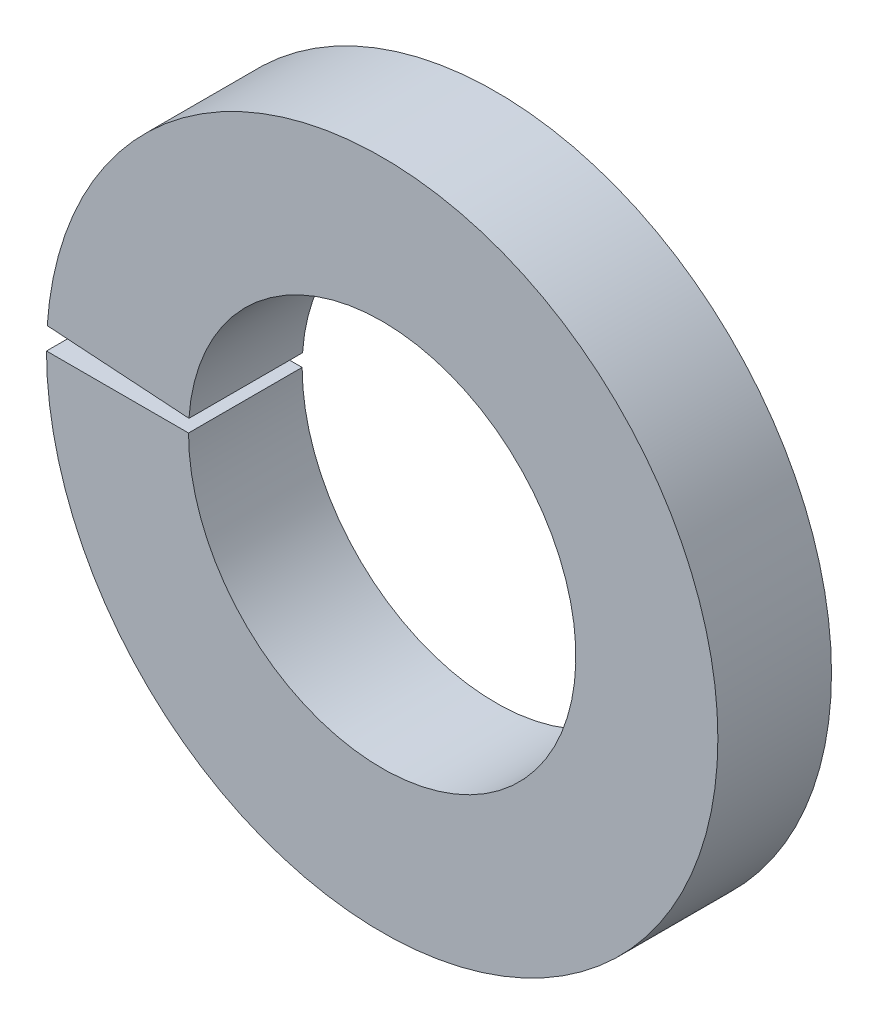
ISO-10303-21;
HEADER;
FILE_DESCRIPTION(('STEP AP214'),'2;1');
FILE_NAME('part.step','',(''),(''),'','','');
FILE_SCHEMA(('AUTOMOTIVE_DESIGN { 1 0 10303 214 1 1 1 1 }'));
ENDSEC;
DATA;
#1=APPLICATION_CONTEXT('core data for automotive mechanical design processes');
#2=APPLICATION_PROTOCOL_DEFINITION('international standard','automotive_design',2000,#1);
#3=PRODUCT_CONTEXT('',#1,'mechanical');
#4=PRODUCT('Part','Part','',(#3));
#5=PRODUCT_RELATED_PRODUCT_CATEGORY('part','',(#4));
#6=PRODUCT_DEFINITION_FORMATION('','',#4);
#7=PRODUCT_DEFINITION_CONTEXT('part definition',#1,'design');
#8=PRODUCT_DEFINITION('design','',#6,#7);
#9=PRODUCT_DEFINITION_SHAPE('','',#8);
#10=(LENGTH_UNIT() NAMED_UNIT(*) SI_UNIT(.MILLI.,.METRE.));
#11=(NAMED_UNIT(*) PLANE_ANGLE_UNIT() SI_UNIT($,.RADIAN.));
#12=(NAMED_UNIT(*) SI_UNIT($,.STERADIAN.) SOLID_ANGLE_UNIT());
#13=UNCERTAINTY_MEASURE_WITH_UNIT(LENGTH_MEASURE(1.E-05),#10,'distance_accuracy_value','');
#14=(GEOMETRIC_REPRESENTATION_CONTEXT(3) GLOBAL_UNCERTAINTY_ASSIGNED_CONTEXT((#13)) GLOBAL_UNIT_ASSIGNED_CONTEXT((#10,
#11,#12)) REPRESENTATION_CONTEXT('',''));
#15=CARTESIAN_POINT('',(0.,0.,0.));
#16=DIRECTION('',(0.,0.,1.));
#17=DIRECTION('',(1.,0.,0.));
#18=AXIS2_PLACEMENT_3D('',#15,#16,#17);
#19=CARTESIAN_POINT('',(0.,0.,0.));
#20=DIRECTION('',(0.,0.,1.));
#21=DIRECTION('',(1.,0.,0.));
#22=AXIS2_PLACEMENT_3D('',#19,#20,#21);
#23=PLANE('',#22);
#24=DIRECTION('',(-1.,0.,0.));
#25=VECTOR('',#24,1.);
#26=CARTESIAN_POINT('',(0.,0.,0.));
#27=LINE('',#26,#25);
#28=CARTESIAN_POINT('',(-1.5,0.,0.));
#29=VERTEX_POINT('',#28);
#30=CARTESIAN_POINT('',(-2.6,0.,0.));
#31=VERTEX_POINT('',#30);
#32=EDGE_CURVE('E27',#29,#31,#27,.T.);
#33=ORIENTED_EDGE('',*,*,#32,.F.);
#34=CARTESIAN_POINT('',(0.,0.,0.));
#35=DIRECTION('',(0.,0.,1.));
#36=DIRECTION('',(1.,0.,0.));
#37=AXIS2_PLACEMENT_3D('',#34,#35,#36);
#38=CIRCLE('',#37,1.5);
#39=CARTESIAN_POINT('',(-1.4966777368836,0.0997785143054241,0.));
#40=VERTEX_POINT('',#39);
#41=EDGE_CURVE('E83',#29,#40,#38,.T.);
#42=ORIENTED_EDGE('',*,*,#41,.T.);
#43=DIRECTION('',(0.997785157922397,-0.0665190095369494,0.));
#44=VECTOR('',#43,1.);
#45=CARTESIAN_POINT('',(-3.00000004470348,0.2,0.));
#46=LINE('',#45,#44);
#47=CARTESIAN_POINT('',(-2.59424141059823,0.172949424796068,0.));
#48=VERTEX_POINT('',#47);
#49=EDGE_CURVE('E69',#48,#40,#46,.T.);
#50=ORIENTED_EDGE('',*,*,#49,.F.);
#51=CARTESIAN_POINT('',(0.,0.,0.));
#52=DIRECTION('',(0.,0.,1.));
#53=DIRECTION('',(1.,0.,0.));
#54=AXIS2_PLACEMENT_3D('',#51,#52,#53);
#55=CIRCLE('',#54,2.6);
#56=EDGE_CURVE('E101',#31,#48,#55,.T.);
#57=ORIENTED_EDGE('',*,*,#56,.F.);
#58=EDGE_LOOP('',(#33,#42,#50,#57));
#59=FACE_BOUND('',#58,.T.);
#60=ADVANCED_FACE('F17',(#59),#23,.F.);
#61=CARTESIAN_POINT('',(0.,0.,0.88));
#62=DIRECTION('',(0.,0.,1.));
#63=DIRECTION('',(1.,0.,0.));
#64=AXIS2_PLACEMENT_3D('',#61,#62,#63);
#65=PLANE('',#64);
#66=DIRECTION('',(-1.,0.,0.));
#67=VECTOR('',#66,1.);
#68=CARTESIAN_POINT('',(0.,0.,0.88));
#69=LINE('',#68,#67);
#70=CARTESIAN_POINT('',(-1.5,0.,0.88));
#71=VERTEX_POINT('',#70);
#72=CARTESIAN_POINT('',(-2.6,0.,0.88));
#73=VERTEX_POINT('',#72);
#74=EDGE_CURVE('E11',#71,#73,#69,.T.);
#75=ORIENTED_EDGE('',*,*,#74,.T.);
#76=CARTESIAN_POINT('',(0.,0.,0.88));
#77=DIRECTION('',(0.,0.,1.));
#78=DIRECTION('',(1.,0.,0.));
#79=AXIS2_PLACEMENT_3D('',#76,#77,#78);
#80=CIRCLE('',#79,2.6);
#81=CARTESIAN_POINT('',(-2.59424141059823,0.172949424796068,0.88));
#82=VERTEX_POINT('',#81);
#83=EDGE_CURVE('E97',#73,#82,#80,.T.);
#84=ORIENTED_EDGE('',*,*,#83,.T.);
#85=DIRECTION('',(0.997785157922397,-0.0665190095369494,0.));
#86=VECTOR('',#85,1.);
#87=CARTESIAN_POINT('',(-3.00000004470348,0.2,0.88));
#88=LINE('',#87,#86);
#89=CARTESIAN_POINT('',(-1.4966777368836,0.0997785143054241,0.88));
#90=VERTEX_POINT('',#89);
#91=EDGE_CURVE('E77',#82,#90,#88,.T.);
#92=ORIENTED_EDGE('',*,*,#91,.T.);
#93=CARTESIAN_POINT('',(0.,0.,0.88));
#94=DIRECTION('',(0.,0.,-1.));
#95=DIRECTION('',(1.,0.,0.));
#96=AXIS2_PLACEMENT_3D('',#93,#94,#95);
#97=CIRCLE('',#96,1.5);
#98=EDGE_CURVE('E84',#90,#71,#97,.T.);
#99=ORIENTED_EDGE('',*,*,#98,.T.);
#100=EDGE_LOOP('',(#75,#84,#92,#99));
#101=FACE_BOUND('',#100,.T.);
#102=ADVANCED_FACE('F118',(#101),#65,.T.);
#103=CARTESIAN_POINT('',(-1.5,0.,0.));
#104=DIRECTION('',(0.,1.,0.));
#105=DIRECTION('',(1.,0.,0.));
#106=AXIS2_PLACEMENT_3D('',#103,#104,#105);
#107=PLANE('',#106);
#108=ORIENTED_EDGE('',*,*,#32,.T.);
#109=DIRECTION('',(0.,0.,1.));
#110=VECTOR('',#109,1.);
#111=CARTESIAN_POINT('',(-2.6,0.,0.));
#112=LINE('',#111,#110);
#113=EDGE_CURVE('E100',#31,#73,#112,.T.);
#114=ORIENTED_EDGE('',*,*,#113,.T.);
#115=ORIENTED_EDGE('',*,*,#74,.F.);
#116=DIRECTION('',(0.,0.,1.));
#117=VECTOR('',#116,1.);
#118=CARTESIAN_POINT('',(-1.5,0.,0.));
#119=LINE('',#118,#117);
#120=EDGE_CURVE('E88',#29,#71,#119,.T.);
#121=ORIENTED_EDGE('',*,*,#120,.F.);
#122=EDGE_LOOP('',(#108,#114,#115,#121));
#123=FACE_BOUND('',#122,.T.);
#124=ADVANCED_FACE('F178',(#123),#107,.T.);
#125=CARTESIAN_POINT('',(0.,0.,0.));
#126=DIRECTION('',(0.,0.,1.));
#127=DIRECTION('',(1.,0.,0.));
#128=AXIS2_PLACEMENT_3D('',#125,#126,#127);
#129=CYLINDRICAL_SURFACE('',#128,2.6);
#130=ORIENTED_EDGE('',*,*,#56,.T.);
#131=DIRECTION('',(0.,0.,1.));
#132=VECTOR('',#131,1.);
#133=CARTESIAN_POINT('',(-2.59424141059823,0.172949424796068,0.));
#134=LINE('',#133,#132);
#135=EDGE_CURVE('E20',#48,#82,#134,.T.);
#136=ORIENTED_EDGE('',*,*,#135,.T.);
#137=ORIENTED_EDGE('',*,*,#83,.F.);
#138=ORIENTED_EDGE('',*,*,#113,.F.);
#139=EDGE_LOOP('',(#130,#136,#137,#138));
#140=FACE_BOUND('',#139,.T.);
#141=ADVANCED_FACE('F168',(#140),#129,.T.);
#142=CARTESIAN_POINT('',(-2.59424141059823,0.172949424796068,0.));
#143=DIRECTION('',(-0.0665190095369494,-0.997785157922397,0.));
#144=DIRECTION('',(-0.997785157922397,0.0665190095369494,0.));
#145=AXIS2_PLACEMENT_3D('',#142,#143,#144);
#146=PLANE('',#145);
#147=ORIENTED_EDGE('',*,*,#49,.T.);
#148=DIRECTION('',(0.,0.,1.));
#149=VECTOR('',#148,1.);
#150=CARTESIAN_POINT('',(-1.4966777368836,0.0997785143054241,0.));
#151=LINE('',#150,#149);
#152=EDGE_CURVE('E73',#40,#90,#151,.T.);
#153=ORIENTED_EDGE('',*,*,#152,.T.);
#154=ORIENTED_EDGE('',*,*,#91,.F.);
#155=ORIENTED_EDGE('',*,*,#135,.F.);
#156=EDGE_LOOP('',(#147,#153,#154,#155));
#157=FACE_BOUND('',#156,.T.);
#158=ADVANCED_FACE('F71',(#157),#146,.T.);
#159=CARTESIAN_POINT('',(0.,0.,0.));
#160=DIRECTION('',(0.,0.,1.));
#161=DIRECTION('',(1.,0.,0.));
#162=AXIS2_PLACEMENT_3D('',#159,#160,#161);
#163=CYLINDRICAL_SURFACE('',#162,1.5);
#164=ORIENTED_EDGE('',*,*,#41,.F.);
#165=ORIENTED_EDGE('',*,*,#120,.T.);
#166=ORIENTED_EDGE('',*,*,#98,.F.);
#167=ORIENTED_EDGE('',*,*,#152,.F.);
#168=EDGE_LOOP('',(#164,#165,#166,#167));
#169=FACE_BOUND('',#168,.T.);
#170=ADVANCED_FACE('F81',(#169),#163,.F.);
#171=CLOSED_SHELL('',(#60,#102,#124,#141,#158,#170));
#172=MANIFOLD_SOLID_BREP('B1',#171);
#173=ADVANCED_BREP_SHAPE_REPRESENTATION('',(#18,#172),#14);
#174=SHAPE_DEFINITION_REPRESENTATION(#9,#173);
ENDSEC;
END-ISO-10303-21;
